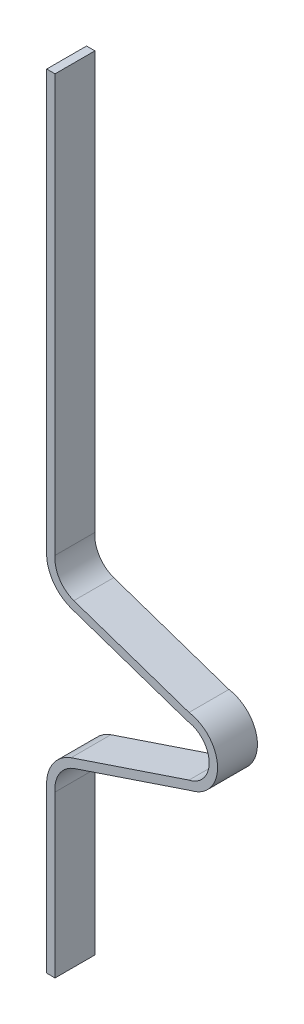
ISO-10303-21;
HEADER;
FILE_DESCRIPTION(('STEP AP214'),'2;1');
FILE_NAME('part.step','',(''),(''),'','','');
FILE_SCHEMA(('AUTOMOTIVE_DESIGN { 1 0 10303 214 1 1 1 1 }'));
ENDSEC;
DATA;
#1=APPLICATION_CONTEXT('core data for automotive mechanical design processes');
#2=APPLICATION_PROTOCOL_DEFINITION('international standard','automotive_design',2000,#1);
#3=PRODUCT_CONTEXT('',#1,'mechanical');
#4=PRODUCT('Part','Part','',(#3));
#5=PRODUCT_RELATED_PRODUCT_CATEGORY('part','',(#4));
#6=PRODUCT_DEFINITION_FORMATION('','',#4);
#7=PRODUCT_DEFINITION_CONTEXT('part definition',#1,'design');
#8=PRODUCT_DEFINITION('design','',#6,#7);
#9=PRODUCT_DEFINITION_SHAPE('','',#8);
#10=(LENGTH_UNIT() NAMED_UNIT(*) SI_UNIT(.MILLI.,.METRE.));
#11=(NAMED_UNIT(*) PLANE_ANGLE_UNIT() SI_UNIT($,.RADIAN.));
#12=(NAMED_UNIT(*) SI_UNIT($,.STERADIAN.) SOLID_ANGLE_UNIT());
#13=UNCERTAINTY_MEASURE_WITH_UNIT(LENGTH_MEASURE(1.E-05),#10,'distance_accuracy_value','');
#14=(GEOMETRIC_REPRESENTATION_CONTEXT(3) GLOBAL_UNCERTAINTY_ASSIGNED_CONTEXT((#13)) GLOBAL_UNIT_ASSIGNED_CONTEXT((#10,
#11,#12)) REPRESENTATION_CONTEXT('',''));
#15=CARTESIAN_POINT('',(0.,0.,0.));
#16=DIRECTION('',(0.,0.,1.));
#17=DIRECTION('',(1.,0.,0.));
#18=AXIS2_PLACEMENT_3D('',#15,#16,#17);
#19=CARTESIAN_POINT('',(7.50002729636842,136.890987131087,-6.2));
#20=DIRECTION('',(0.,0.,1.));
#21=DIRECTION('',(1.,0.,0.));
#22=AXIS2_PLACEMENT_3D('',#19,#20,#21);
#23=CYLINDRICAL_SURFACE('',#22,5.80000000000005);
#24=CARTESIAN_POINT('',(7.50002729636842,136.890987131087,0.));
#25=DIRECTION('',(0.,0.,-1.));
#26=DIRECTION('',(-1.,0.,0.));
#27=AXIS2_PLACEMENT_3D('',#24,#25,#26);
#28=CIRCLE('',#27,5.80000000000005);
#29=CARTESIAN_POINT('',(5.50463373490959,131.445034089158,0.));
#30=VERTEX_POINT('',#29);
#31=CARTESIAN_POINT('',(1.71947576625623,137.365564846238,0.));
#32=VERTEX_POINT('',#31);
#33=EDGE_CURVE('E186',#30,#32,#28,.T.);
#34=ORIENTED_EDGE('',*,*,#33,.T.);
#35=DIRECTION('',(0.,0.,1.));
#36=VECTOR('',#35,1.);
#37=CARTESIAN_POINT('',(1.71947576625623,137.365564846238,-6.2));
#38=LINE('',#37,#36);
#39=CARTESIAN_POINT('',(1.71947576625623,137.365564846238,-6.2));
#40=VERTEX_POINT('',#39);
#41=EDGE_CURVE('E42',#40,#32,#38,.T.);
#42=ORIENTED_EDGE('',*,*,#41,.F.);
#43=CARTESIAN_POINT('',(7.50002729636842,136.890987131087,-6.2));
#44=DIRECTION('',(0.,0.,-1.));
#45=DIRECTION('',(-1.,0.,0.));
#46=AXIS2_PLACEMENT_3D('',#43,#44,#45);
#47=CIRCLE('',#46,5.80000000000005);
#48=CARTESIAN_POINT('',(5.50463373490959,131.445034089158,-6.2));
#49=VERTEX_POINT('',#48);
#50=EDGE_CURVE('E224',#49,#40,#47,.T.);
#51=ORIENTED_EDGE('',*,*,#50,.F.);
#52=DIRECTION('',(0.,0.,1.));
#53=VECTOR('',#52,1.);
#54=CARTESIAN_POINT('',(5.50463373490959,131.445034089158,-6.2));
#55=LINE('',#54,#53);
#56=EDGE_CURVE('E185',#49,#30,#55,.T.);
#57=ORIENTED_EDGE('',*,*,#56,.T.);
#58=EDGE_LOOP('',(#34,#42,#51,#57));
#59=FACE_BOUND('',#58,.T.);
#60=ADVANCED_FACE('F35',(#59),#23,.T.);
#61=CARTESIAN_POINT('',(1.71947576625623,137.365564846238,-6.2));
#62=DIRECTION('',(1.,0.,0.));
#63=DIRECTION('',(0.,1.,0.));
#64=AXIS2_PLACEMENT_3D('',#61,#62,#63);
#65=PLANE('',#64);
#66=DIRECTION('',(0.,1.,0.));
#67=VECTOR('',#66,1.);
#68=CARTESIAN_POINT('',(1.71947576625623,137.365564846238,0.));
#69=LINE('',#68,#67);
#70=CARTESIAN_POINT('',(1.71947576625623,202.142033293371,0.));
#71=VERTEX_POINT('',#70);
#72=EDGE_CURVE('E189',#32,#71,#69,.T.);
#73=ORIENTED_EDGE('',*,*,#72,.T.);
#74=DIRECTION('',(0.,0.,-1.));
#75=VECTOR('',#74,1.);
#76=CARTESIAN_POINT('',(1.71947576625623,202.142033293371,-6.2));
#77=LINE('',#76,#75);
#78=CARTESIAN_POINT('',(1.71947576625623,202.142033293371,-6.2));
#79=VERTEX_POINT('',#78);
#80=EDGE_CURVE('E57',#71,#79,#77,.T.);
#81=ORIENTED_EDGE('',*,*,#80,.T.);
#82=DIRECTION('',(0.,1.,0.));
#83=VECTOR('',#82,1.);
#84=CARTESIAN_POINT('',(1.71947576625623,137.365564846238,-6.2));
#85=LINE('',#84,#83);
#86=EDGE_CURVE('E251',#40,#79,#85,.T.);
#87=ORIENTED_EDGE('',*,*,#86,.F.);
#88=ORIENTED_EDGE('',*,*,#41,.T.);
#89=EDGE_LOOP('',(#73,#81,#87,#88));
#90=FACE_BOUND('',#89,.T.);
#91=ADVANCED_FACE('F249',(#90),#65,.F.);
#92=CARTESIAN_POINT('',(3.01947576625623,137.308908159523,-6.2));
#93=DIRECTION('',(1.,0.,0.));
#94=DIRECTION('',(0.,1.,0.));
#95=AXIS2_PLACEMENT_3D('',#92,#93,#94);
#96=PLANE('',#95);
#97=DIRECTION('',(0.,0.,-1.));
#98=VECTOR('',#97,1.);
#99=CARTESIAN_POINT('',(3.01947576625058,202.142033293371,-6.2));
#100=LINE('',#99,#98);
#101=CARTESIAN_POINT('',(3.01947576625058,202.142033293371,0.));
#102=VERTEX_POINT('',#101);
#103=CARTESIAN_POINT('',(3.01947576625058,202.142033293371,-6.2));
#104=VERTEX_POINT('',#103);
#105=EDGE_CURVE('E280',#102,#104,#100,.T.);
#106=ORIENTED_EDGE('',*,*,#105,.F.);
#107=DIRECTION('',(0.,1.,0.));
#108=VECTOR('',#107,1.);
#109=CARTESIAN_POINT('',(3.01947576625623,137.308908159523,0.));
#110=LINE('',#109,#108);
#111=CARTESIAN_POINT('',(3.01947576625623,137.308908159523,0.));
#112=VERTEX_POINT('',#111);
#113=EDGE_CURVE('E192',#112,#102,#110,.T.);
#114=ORIENTED_EDGE('',*,*,#113,.F.);
#115=DIRECTION('',(0.,0.,1.));
#116=VECTOR('',#115,1.);
#117=CARTESIAN_POINT('',(3.01947576625623,137.308908159523,-6.2));
#118=LINE('',#117,#116);
#119=CARTESIAN_POINT('',(3.01947576625623,137.308908159523,-6.2));
#120=VERTEX_POINT('',#119);
#121=EDGE_CURVE('E245',#120,#112,#118,.T.);
#122=ORIENTED_EDGE('',*,*,#121,.F.);
#123=DIRECTION('',(0.,1.,0.));
#124=VECTOR('',#123,1.);
#125=CARTESIAN_POINT('',(3.01947576625623,137.308908159523,-6.2));
#126=LINE('',#125,#124);
#127=EDGE_CURVE('E290',#120,#104,#126,.T.);
#128=ORIENTED_EDGE('',*,*,#127,.T.);
#129=EDGE_LOOP('',(#106,#114,#122,#128));
#130=FACE_BOUND('',#129,.T.);
#131=ADVANCED_FACE('F326',(#130),#96,.T.);
#132=CARTESIAN_POINT('',(7.50002729636842,136.890987131087,-6.2));
#133=DIRECTION('',(0.,0.,1.));
#134=DIRECTION('',(1.,0.,0.));
#135=AXIS2_PLACEMENT_3D('',#132,#133,#134);
#136=CYLINDRICAL_SURFACE('',#135,4.50000000000005);
#137=CARTESIAN_POINT('',(7.50002729636842,136.890987131087,0.));
#138=DIRECTION('',(0.,0.,-1.));
#139=DIRECTION('',(-1.,0.,0.));
#140=AXIS2_PLACEMENT_3D('',#137,#138,#139);
#141=CIRCLE('',#140,4.50000000000005);
#142=CARTESIAN_POINT('',(5.93858449700011,132.670572887876,0.));
#143=VERTEX_POINT('',#142);
#144=EDGE_CURVE('E195',#143,#112,#141,.T.);
#145=ORIENTED_EDGE('',*,*,#144,.F.);
#146=DIRECTION('',(0.,0.,1.));
#147=VECTOR('',#146,1.);
#148=CARTESIAN_POINT('',(5.93858449700011,132.670572887876,-6.2));
#149=LINE('',#148,#147);
#150=CARTESIAN_POINT('',(5.93858449700011,132.670572887876,-6.2));
#151=VERTEX_POINT('',#150);
#152=EDGE_CURVE('E243',#151,#143,#149,.T.);
#153=ORIENTED_EDGE('',*,*,#152,.F.);
#154=CARTESIAN_POINT('',(7.50002729636842,136.890987131087,-6.2));
#155=DIRECTION('',(0.,0.,-1.));
#156=DIRECTION('',(-1.,0.,0.));
#157=AXIS2_PLACEMENT_3D('',#154,#155,#156);
#158=CIRCLE('',#157,4.50000000000005);
#159=EDGE_CURVE('E293',#151,#120,#158,.T.);
#160=ORIENTED_EDGE('',*,*,#159,.T.);
#161=ORIENTED_EDGE('',*,*,#121,.T.);
#162=EDGE_LOOP('',(#145,#153,#160,#161));
#163=FACE_BOUND('',#162,.T.);
#164=ADVANCED_FACE('F330',(#163),#136,.F.);
#165=CARTESIAN_POINT('',(5.9385844970001,132.670572887876,-6.2));
#166=DIRECTION('',(-0.322097234531556,-0.946706592090244,0.));
#167=DIRECTION('',(0.946706592090244,-0.322097234531556,0.));
#168=AXIS2_PLACEMENT_3D('',#165,#166,#167);
#169=PLANE('',#168);
#170=DIRECTION('',(0.946706592090244,-0.322097234531556,0.));
#171=VECTOR('',#170,1.);
#172=CARTESIAN_POINT('',(5.9385844970001,132.670572887876,0.));
#173=LINE('',#172,#171);
#174=CARTESIAN_POINT('',(23.8530536017611,126.575547243231,0.));
#175=VERTEX_POINT('',#174);
#176=EDGE_CURVE('E198',#143,#175,#173,.T.);
#177=ORIENTED_EDGE('',*,*,#176,.T.);
#178=DIRECTION('',(0.,0.,1.));
#179=VECTOR('',#178,1.);
#180=CARTESIAN_POINT('',(23.8530536017611,126.575547243231,-6.2));
#181=LINE('',#180,#179);
#182=CARTESIAN_POINT('',(23.8530536017611,126.575547243231,-6.2));
#183=VERTEX_POINT('',#182);
#184=EDGE_CURVE('E241',#183,#175,#181,.T.);
#185=ORIENTED_EDGE('',*,*,#184,.F.);
#186=DIRECTION('',(0.946706592090244,-0.322097234531556,0.));
#187=VECTOR('',#186,1.);
#188=CARTESIAN_POINT('',(5.9385844970001,132.670572887876,-6.2));
#189=LINE('',#188,#187);
#190=EDGE_CURVE('E296',#151,#183,#189,.T.);
#191=ORIENTED_EDGE('',*,*,#190,.F.);
#192=ORIENTED_EDGE('',*,*,#152,.T.);
#193=EDGE_LOOP('',(#177,#185,#191,#192));
#194=FACE_BOUND('',#193,.T.);
#195=ADVANCED_FACE('F336',(#194),#169,.F.);
#196=CARTESIAN_POINT('',(23.0000272963693,121.361325624567,-6.2));
#197=DIRECTION('',(0.,0.,1.));
#198=DIRECTION('',(1.,0.,0.));
#199=AXIS2_PLACEMENT_3D('',#196,#197,#198);
#200=CYLINDRICAL_SURFACE('',#199,5.28353678573665);
#201=CARTESIAN_POINT('',(23.0000272963693,121.361325624567,0.));
#202=DIRECTION('',(0.,0.,1.));
#203=DIRECTION('',(1.,0.,0.));
#204=AXIS2_PLACEMENT_3D('',#201,#202,#203);
#205=CIRCLE('',#204,5.28353678573665);
#206=CARTESIAN_POINT('',(24.1981690487475,116.215432377769,0.));
#207=VERTEX_POINT('',#206);
#208=EDGE_CURVE('E201',#207,#175,#205,.T.);
#209=ORIENTED_EDGE('',*,*,#208,.F.);
#210=DIRECTION('',(0.,0.,1.));
#211=VECTOR('',#210,1.);
#212=CARTESIAN_POINT('',(24.1981690487475,116.215432377769,-6.2));
#213=LINE('',#212,#211);
#214=CARTESIAN_POINT('',(24.1981690487475,116.215432377769,-6.2));
#215=VERTEX_POINT('',#214);
#216=EDGE_CURVE('E239',#215,#207,#213,.T.);
#217=ORIENTED_EDGE('',*,*,#216,.F.);
#218=CARTESIAN_POINT('',(23.0000272963693,121.361325624567,-6.2));
#219=DIRECTION('',(0.,0.,1.));
#220=DIRECTION('',(1.,0.,0.));
#221=AXIS2_PLACEMENT_3D('',#218,#219,#220);
#222=CIRCLE('',#221,5.28353678573665);
#223=EDGE_CURVE('E298',#215,#183,#222,.T.);
#224=ORIENTED_EDGE('',*,*,#223,.T.);
#225=ORIENTED_EDGE('',*,*,#184,.T.);
#226=EDGE_LOOP('',(#209,#217,#224,#225));
#227=FACE_BOUND('',#226,.T.);
#228=ADVANCED_FACE('F310',(#227),#200,.T.);
#229=CARTESIAN_POINT('',(5.93769252692713,110.081409755031,-6.2));
#230=DIRECTION('',(0.318432016999955,-0.947945700211431,0.));
#231=DIRECTION('',(0.947945700211431,0.318432016999955,0.));
#232=AXIS2_PLACEMENT_3D('',#229,#230,#231);
#233=PLANE('',#232);
#234=DIRECTION('',(0.947945700211431,0.318432016999955,0.));
#235=VECTOR('',#234,1.);
#236=CARTESIAN_POINT('',(5.93769252692713,110.081409755031,0.));
#237=LINE('',#236,#235);
#238=CARTESIAN_POINT('',(5.93769252692713,110.081409755031,0.));
#239=VERTEX_POINT('',#238);
#240=EDGE_CURVE('E204',#239,#207,#237,.T.);
#241=ORIENTED_EDGE('',*,*,#240,.F.);
#242=DIRECTION('',(0.,0.,1.));
#243=VECTOR('',#242,1.);
#244=CARTESIAN_POINT('',(5.93769252692713,110.081409755031,-6.2));
#245=LINE('',#244,#243);
#246=CARTESIAN_POINT('',(5.93769252692713,110.081409755031,-6.2));
#247=VERTEX_POINT('',#246);
#248=EDGE_CURVE('E237',#247,#239,#245,.T.);
#249=ORIENTED_EDGE('',*,*,#248,.F.);
#250=DIRECTION('',(0.947945700211431,0.318432016999955,0.));
#251=VECTOR('',#250,1.);
#252=CARTESIAN_POINT('',(5.93769252692713,110.081409755031,-6.2));
#253=LINE('',#252,#251);
#254=EDGE_CURVE('E172',#247,#215,#253,.T.);
#255=ORIENTED_EDGE('',*,*,#254,.T.);
#256=ORIENTED_EDGE('',*,*,#216,.T.);
#257=EDGE_LOOP('',(#241,#249,#255,#256));
#258=FACE_BOUND('',#257,.T.);
#259=ADVANCED_FACE('F303',(#258),#233,.T.);
#260=CARTESIAN_POINT('',(7.50002729636842,105.861325624567,-6.2));
#261=DIRECTION('',(0.,0.,1.));
#262=DIRECTION('',(1.,0.,0.));
#263=AXIS2_PLACEMENT_3D('',#260,#261,#262);
#264=CYLINDRICAL_SURFACE('',#263,4.49999999999999);
#265=CARTESIAN_POINT('',(7.50002729636842,105.861325624567,0.));
#266=DIRECTION('',(0.,0.,1.));
#267=DIRECTION('',(1.,0.,0.));
#268=AXIS2_PLACEMENT_3D('',#265,#266,#267);
#269=CIRCLE('',#268,4.49999999999999);
#270=CARTESIAN_POINT('',(3.01947576625624,105.443404596131,0.));
#271=VERTEX_POINT('',#270);
#272=EDGE_CURVE('E207',#239,#271,#269,.T.);
#273=ORIENTED_EDGE('',*,*,#272,.T.);
#274=DIRECTION('',(0.,0.,1.));
#275=VECTOR('',#274,1.);
#276=CARTESIAN_POINT('',(3.01947576625624,105.443404596131,-6.2));
#277=LINE('',#276,#275);
#278=CARTESIAN_POINT('',(3.01947576625624,105.443404596131,-6.2));
#279=VERTEX_POINT('',#278);
#280=EDGE_CURVE('E235',#279,#271,#277,.T.);
#281=ORIENTED_EDGE('',*,*,#280,.F.);
#282=CARTESIAN_POINT('',(7.50002729636842,105.861325624567,-6.2));
#283=DIRECTION('',(0.,0.,1.));
#284=DIRECTION('',(1.,0.,0.));
#285=AXIS2_PLACEMENT_3D('',#282,#283,#284);
#286=CIRCLE('',#285,4.49999999999999);
#287=EDGE_CURVE('E166',#247,#279,#286,.T.);
#288=ORIENTED_EDGE('',*,*,#287,.F.);
#289=ORIENTED_EDGE('',*,*,#248,.T.);
#290=EDGE_LOOP('',(#273,#281,#288,#289));
#291=FACE_BOUND('',#290,.T.);
#292=ADVANCED_FACE('F313',(#291),#264,.F.);
#293=CARTESIAN_POINT('',(3.01947576625623,105.443404596131,-6.2));
#294=DIRECTION('',(-1.,0.,0.));
#295=DIRECTION('',(0.,-1.,0.));
#296=AXIS2_PLACEMENT_3D('',#293,#294,#295);
#297=PLANE('',#296);
#298=DIRECTION('',(0.,-1.,0.));
#299=VECTOR('',#298,1.);
#300=CARTESIAN_POINT('',(3.01947576625623,105.443404596131,0.));
#301=LINE('',#300,#299);
#302=CARTESIAN_POINT('',(3.01947576625623,80.4063512397133,0.));
#303=VERTEX_POINT('',#302);
#304=EDGE_CURVE('E161',#271,#303,#301,.T.);
#305=ORIENTED_EDGE('',*,*,#304,.T.);
#306=DIRECTION('',(0.,0.,1.));
#307=VECTOR('',#306,1.);
#308=CARTESIAN_POINT('',(3.01947576625848,80.4063512397133,-6.2));
#309=LINE('',#308,#307);
#310=CARTESIAN_POINT('',(3.01947576625848,80.4063512397133,-6.2));
#311=VERTEX_POINT('',#310);
#312=EDGE_CURVE('E49',#311,#303,#309,.T.);
#313=ORIENTED_EDGE('',*,*,#312,.F.);
#314=DIRECTION('',(0.,-1.,0.));
#315=VECTOR('',#314,1.);
#316=CARTESIAN_POINT('',(3.01947576625623,105.443404596131,-6.2));
#317=LINE('',#316,#315);
#318=EDGE_CURVE('E159',#279,#311,#317,.T.);
#319=ORIENTED_EDGE('',*,*,#318,.F.);
#320=ORIENTED_EDGE('',*,*,#280,.T.);
#321=EDGE_LOOP('',(#305,#313,#319,#320));
#322=FACE_BOUND('',#321,.T.);
#323=ADVANCED_FACE('F157',(#322),#297,.F.);
#324=CARTESIAN_POINT('',(1.71947576625623,105.386747909417,-6.2));
#325=DIRECTION('',(-1.,0.,0.));
#326=DIRECTION('',(0.,-1.,0.));
#327=AXIS2_PLACEMENT_3D('',#324,#325,#326);
#328=PLANE('',#327);
#329=DIRECTION('',(0.,0.,-1.));
#330=VECTOR('',#329,1.);
#331=CARTESIAN_POINT('',(1.71947576625623,80.4063512397133,-6.2));
#332=LINE('',#331,#330);
#333=CARTESIAN_POINT('',(1.71947576625623,80.4063512397133,0.));
#334=VERTEX_POINT('',#333);
#335=CARTESIAN_POINT('',(1.71947576625623,80.4063512397133,-6.2));
#336=VERTEX_POINT('',#335);
#337=EDGE_CURVE('E147',#334,#336,#332,.T.);
#338=ORIENTED_EDGE('',*,*,#337,.F.);
#339=DIRECTION('',(0.,-1.,0.));
#340=VECTOR('',#339,1.);
#341=CARTESIAN_POINT('',(1.71947576625623,105.386747909417,0.));
#342=LINE('',#341,#340);
#343=CARTESIAN_POINT('',(1.71947576625623,105.386747909417,0.));
#344=VERTEX_POINT('',#343);
#345=EDGE_CURVE('E210',#344,#334,#342,.T.);
#346=ORIENTED_EDGE('',*,*,#345,.F.);
#347=DIRECTION('',(0.,0.,1.));
#348=VECTOR('',#347,1.);
#349=CARTESIAN_POINT('',(1.71947576625623,105.386747909417,-6.2));
#350=LINE('',#349,#348);
#351=CARTESIAN_POINT('',(1.71947576625623,105.386747909417,-6.2));
#352=VERTEX_POINT('',#351);
#353=EDGE_CURVE('E233',#352,#344,#350,.T.);
#354=ORIENTED_EDGE('',*,*,#353,.F.);
#355=DIRECTION('',(0.,-1.,0.));
#356=VECTOR('',#355,1.);
#357=CARTESIAN_POINT('',(1.71947576625623,105.386747909417,-6.2));
#358=LINE('',#357,#356);
#359=EDGE_CURVE('E168',#352,#336,#358,.T.);
#360=ORIENTED_EDGE('',*,*,#359,.T.);
#361=EDGE_LOOP('',(#338,#346,#354,#360));
#362=FACE_BOUND('',#361,.T.);
#363=ADVANCED_FACE('F277',(#362),#328,.T.);
#364=CARTESIAN_POINT('',(7.50002729636842,105.861325624567,-6.2));
#365=DIRECTION('',(0.,0.,1.));
#366=DIRECTION('',(1.,0.,0.));
#367=AXIS2_PLACEMENT_3D('',#364,#365,#366);
#368=CYLINDRICAL_SURFACE('',#367,5.8);
#369=CARTESIAN_POINT('',(7.50002729636842,105.861325624567,0.));
#370=DIRECTION('',(0.,0.,1.));
#371=DIRECTION('',(1.,0.,0.));
#372=AXIS2_PLACEMENT_3D('',#369,#370,#371);
#373=CIRCLE('',#372,5.8);
#374=CARTESIAN_POINT('',(5.50613135155277,111.307827158694,0.));
#375=VERTEX_POINT('',#374);
#376=EDGE_CURVE('E213',#375,#344,#373,.T.);
#377=ORIENTED_EDGE('',*,*,#376,.F.);
#378=DIRECTION('',(0.,0.,1.));
#379=VECTOR('',#378,1.);
#380=CARTESIAN_POINT('',(5.50613135155277,111.307827158694,-6.2));
#381=LINE('',#380,#379);
#382=CARTESIAN_POINT('',(5.50613135155277,111.307827158694,-6.2));
#383=VERTEX_POINT('',#382);
#384=EDGE_CURVE('E231',#383,#375,#381,.T.);
#385=ORIENTED_EDGE('',*,*,#384,.F.);
#386=CARTESIAN_POINT('',(7.50002729636842,105.861325624567,-6.2));
#387=DIRECTION('',(0.,0.,1.));
#388=DIRECTION('',(1.,0.,0.));
#389=AXIS2_PLACEMENT_3D('',#386,#387,#388);
#390=CIRCLE('',#389,5.8);
#391=EDGE_CURVE('E170',#383,#352,#390,.T.);
#392=ORIENTED_EDGE('',*,*,#391,.T.);
#393=ORIENTED_EDGE('',*,*,#353,.T.);
#394=EDGE_LOOP('',(#377,#385,#392,#393));
#395=FACE_BOUND('',#394,.T.);
#396=ADVANCED_FACE('F272',(#395),#368,.T.);
#397=CARTESIAN_POINT('',(5.50613135155277,111.307827158694,-6.2));
#398=DIRECTION('',(0.318432016999952,-0.947945700211432,0.));
#399=DIRECTION('',(0.947945700211432,0.318432016999952,0.));
#400=AXIS2_PLACEMENT_3D('',#397,#398,#399);
#401=PLANE('',#400);
#402=DIRECTION('',(0.947945700211432,0.318432016999952,0.));
#403=VECTOR('',#402,1.);
#404=CARTESIAN_POINT('',(5.50613135155277,111.307827158694,0.));
#405=LINE('',#404,#403);
#406=CARTESIAN_POINT('',(23.8471362015121,117.468900695792,0.));
#407=VERTEX_POINT('',#406);
#408=EDGE_CURVE('E216',#375,#407,#405,.T.);
#409=ORIENTED_EDGE('',*,*,#408,.T.);
#410=DIRECTION('',(0.,0.,1.));
#411=VECTOR('',#410,1.);
#412=CARTESIAN_POINT('',(23.8471362015121,117.468900695792,-6.2));
#413=LINE('',#412,#411);
#414=CARTESIAN_POINT('',(23.8471362015121,117.468900695792,-6.2));
#415=VERTEX_POINT('',#414);
#416=EDGE_CURVE('E228',#415,#407,#413,.T.);
#417=ORIENTED_EDGE('',*,*,#416,.F.);
#418=DIRECTION('',(0.947945700211432,0.318432016999952,0.));
#419=VECTOR('',#418,1.);
#420=CARTESIAN_POINT('',(5.50613135155277,111.307827158694,-6.2));
#421=LINE('',#420,#419);
#422=EDGE_CURVE('E178',#383,#415,#421,.T.);
#423=ORIENTED_EDGE('',*,*,#422,.F.);
#424=ORIENTED_EDGE('',*,*,#384,.T.);
#425=EDGE_LOOP('',(#409,#417,#423,#424));
#426=FACE_BOUND('',#425,.T.);
#427=ADVANCED_FACE('F364',(#426),#401,.F.);
#428=CARTESIAN_POINT('',(23.0000272963693,121.361325624567,-6.2));
#429=DIRECTION('',(0.,0.,1.));
#430=DIRECTION('',(1.,0.,0.));
#431=AXIS2_PLACEMENT_3D('',#428,#429,#430);
#432=CYLINDRICAL_SURFACE('',#431,3.98353678573665);
#433=CARTESIAN_POINT('',(23.0000272963693,121.361325624567,0.));
#434=DIRECTION('',(0.,0.,1.));
#435=DIRECTION('',(1.,0.,0.));
#436=AXIS2_PLACEMENT_3D('',#433,#434,#435);
#437=CIRCLE('',#436,3.98353678573665);
#438=CARTESIAN_POINT('',(23.5438434058974,125.307568060395,0.));
#439=VERTEX_POINT('',#438);
#440=EDGE_CURVE('E218',#407,#439,#437,.T.);
#441=ORIENTED_EDGE('',*,*,#440,.T.);
#442=DIRECTION('',(0.,0.,1.));
#443=VECTOR('',#442,1.);
#444=CARTESIAN_POINT('',(23.5438434058974,125.307568060395,-6.2));
#445=LINE('',#444,#443);
#446=CARTESIAN_POINT('',(23.5438434058974,125.307568060395,-6.2));
#447=VERTEX_POINT('',#446);
#448=EDGE_CURVE('E226',#447,#439,#445,.T.);
#449=ORIENTED_EDGE('',*,*,#448,.F.);
#450=CARTESIAN_POINT('',(23.0000272963693,121.361325624567,-6.2));
#451=DIRECTION('',(0.,0.,1.));
#452=DIRECTION('',(1.,0.,0.));
#453=AXIS2_PLACEMENT_3D('',#450,#451,#452);
#454=CIRCLE('',#453,3.98353678573665);
#455=EDGE_CURVE('E180',#415,#447,#454,.T.);
#456=ORIENTED_EDGE('',*,*,#455,.F.);
#457=ORIENTED_EDGE('',*,*,#416,.T.);
#458=EDGE_LOOP('',(#441,#449,#456,#457));
#459=FACE_BOUND('',#458,.T.);
#460=ADVANCED_FACE('F266',(#459),#432,.F.);
#461=CARTESIAN_POINT('',(5.50463373490959,131.445034089158,-6.2));
#462=DIRECTION('',(-0.322097234531554,-0.946706592090245,0.));
#463=DIRECTION('',(0.946706592090245,-0.322097234531554,0.));
#464=AXIS2_PLACEMENT_3D('',#461,#462,#463);
#465=PLANE('',#464);
#466=DIRECTION('',(0.946706592090245,-0.322097234531554,0.));
#467=VECTOR('',#466,1.);
#468=CARTESIAN_POINT('',(5.50463373490959,131.445034089158,0.));
#469=LINE('',#468,#467);
#470=EDGE_CURVE('E221',#30,#439,#469,.T.);
#471=ORIENTED_EDGE('',*,*,#470,.F.);
#472=ORIENTED_EDGE('',*,*,#56,.F.);
#473=DIRECTION('',(0.946706592090245,-0.322097234531554,0.));
#474=VECTOR('',#473,1.);
#475=CARTESIAN_POINT('',(5.50463373490959,131.445034089158,-6.2));
#476=LINE('',#475,#474);
#477=EDGE_CURVE('E182',#49,#447,#476,.T.);
#478=ORIENTED_EDGE('',*,*,#477,.T.);
#479=ORIENTED_EDGE('',*,*,#448,.T.);
#480=EDGE_LOOP('',(#471,#472,#478,#479));
#481=FACE_BOUND('',#480,.T.);
#482=ADVANCED_FACE('F261',(#481),#465,.T.);
#483=CARTESIAN_POINT('',(7.50002729636842,136.890987131087,-6.2));
#484=DIRECTION('',(0.,0.,-1.));
#485=DIRECTION('',(-1.,0.,0.));
#486=AXIS2_PLACEMENT_3D('',#483,#484,#485);
#487=PLANE('',#486);
#488=DIRECTION('',(1.,0.,0.));
#489=VECTOR('',#488,1.);
#490=CARTESIAN_POINT('',(-6.98052423374152,80.4063512397136,-6.2));
#491=LINE('',#490,#489);
#492=EDGE_CURVE('E144',#336,#311,#491,.T.);
#493=ORIENTED_EDGE('',*,*,#492,.F.);
#494=ORIENTED_EDGE('',*,*,#359,.F.);
#495=ORIENTED_EDGE('',*,*,#391,.F.);
#496=ORIENTED_EDGE('',*,*,#422,.T.);
#497=ORIENTED_EDGE('',*,*,#455,.T.);
#498=ORIENTED_EDGE('',*,*,#477,.F.);
#499=ORIENTED_EDGE('',*,*,#50,.T.);
#500=ORIENTED_EDGE('',*,*,#86,.T.);
#501=DIRECTION('',(1.,0.,0.));
#502=VECTOR('',#501,1.);
#503=CARTESIAN_POINT('',(-6.98052423374942,202.142033293371,-6.2));
#504=LINE('',#503,#502);
#505=EDGE_CURVE('E284',#79,#104,#504,.T.);
#506=ORIENTED_EDGE('',*,*,#505,.T.);
#507=ORIENTED_EDGE('',*,*,#127,.F.);
#508=ORIENTED_EDGE('',*,*,#159,.F.);
#509=ORIENTED_EDGE('',*,*,#190,.T.);
#510=ORIENTED_EDGE('',*,*,#223,.F.);
#511=ORIENTED_EDGE('',*,*,#254,.F.);
#512=ORIENTED_EDGE('',*,*,#287,.T.);
#513=ORIENTED_EDGE('',*,*,#318,.T.);
#514=EDGE_LOOP('',(#493,#494,#495,#496,#497,#498,#499,#500,#506,#507,#508,#509,#510,#511,#512,#513));
#515=FACE_BOUND('',#514,.T.);
#516=ADVANCED_FACE('F163',(#515),#487,.T.);
#517=CARTESIAN_POINT('',(7.50002729636842,136.890987131087,0.));
#518=DIRECTION('',(0.,0.,-1.));
#519=DIRECTION('',(-1.,0.,0.));
#520=AXIS2_PLACEMENT_3D('',#517,#518,#519);
#521=PLANE('',#520);
#522=ORIENTED_EDGE('',*,*,#345,.T.);
#523=DIRECTION('',(1.,0.,0.));
#524=VECTOR('',#523,1.);
#525=CARTESIAN_POINT('',(-6.98052423374152,80.4063512397136,0.));
#526=LINE('',#525,#524);
#527=EDGE_CURVE('E152',#334,#303,#526,.T.);
#528=ORIENTED_EDGE('',*,*,#527,.T.);
#529=ORIENTED_EDGE('',*,*,#304,.F.);
#530=ORIENTED_EDGE('',*,*,#272,.F.);
#531=ORIENTED_EDGE('',*,*,#240,.T.);
#532=ORIENTED_EDGE('',*,*,#208,.T.);
#533=ORIENTED_EDGE('',*,*,#176,.F.);
#534=ORIENTED_EDGE('',*,*,#144,.T.);
#535=ORIENTED_EDGE('',*,*,#113,.T.);
#536=DIRECTION('',(-1.,0.,0.));
#537=VECTOR('',#536,1.);
#538=CARTESIAN_POINT('',(7.5000272963666,202.142033293371,0.));
#539=LINE('',#538,#537);
#540=EDGE_CURVE('E11',#102,#71,#539,.T.);
#541=ORIENTED_EDGE('',*,*,#540,.T.);
#542=ORIENTED_EDGE('',*,*,#72,.F.);
#543=ORIENTED_EDGE('',*,*,#33,.F.);
#544=ORIENTED_EDGE('',*,*,#470,.T.);
#545=ORIENTED_EDGE('',*,*,#440,.F.);
#546=ORIENTED_EDGE('',*,*,#408,.F.);
#547=ORIENTED_EDGE('',*,*,#376,.T.);
#548=EDGE_LOOP('',(#522,#528,#529,#530,#531,#532,#533,#534,#535,#541,#542,#543,#544,#545,#546,#547));
#549=FACE_BOUND('',#548,.T.);
#550=ADVANCED_FACE('F258',(#549),#521,.F.);
#551=CARTESIAN_POINT('',(-6.98052423374942,202.142033293371,-6.2));
#552=DIRECTION('',(0.,-1.,0.));
#553=DIRECTION('',(1.,0.,0.));
#554=AXIS2_PLACEMENT_3D('',#551,#552,#553);
#555=PLANE('',#554);
#556=ORIENTED_EDGE('',*,*,#540,.F.);
#557=ORIENTED_EDGE('',*,*,#105,.T.);
#558=ORIENTED_EDGE('',*,*,#505,.F.);
#559=ORIENTED_EDGE('',*,*,#80,.F.);
#560=EDGE_LOOP('',(#556,#557,#558,#559));
#561=FACE_BOUND('',#560,.T.);
#562=ADVANCED_FACE('F409',(#561),#555,.F.);
#563=CARTESIAN_POINT('',(-6.98052423374152,80.4063512397136,-6.2));
#564=DIRECTION('',(0.,1.,0.));
#565=DIRECTION('',(-1.,0.,0.));
#566=AXIS2_PLACEMENT_3D('',#563,#564,#565);
#567=PLANE('',#566);
#568=ORIENTED_EDGE('',*,*,#337,.T.);
#569=ORIENTED_EDGE('',*,*,#492,.T.);
#570=ORIENTED_EDGE('',*,*,#312,.T.);
#571=ORIENTED_EDGE('',*,*,#527,.F.);
#572=EDGE_LOOP('',(#568,#569,#570,#571));
#573=FACE_BOUND('',#572,.T.);
#574=ADVANCED_FACE('F145',(#573),#567,.F.);
#575=CLOSED_SHELL('',(#60,#91,#131,#164,#195,#228,#259,#292,#323,#363,#396,#427,#460,#482,#516,
#550,#562,#574));
#576=MANIFOLD_SOLID_BREP('B2',#575);
#577=ADVANCED_BREP_SHAPE_REPRESENTATION('',(#18,#576),#14);
#578=SHAPE_DEFINITION_REPRESENTATION(#9,#577);
ENDSEC;
END-ISO-10303-21;
